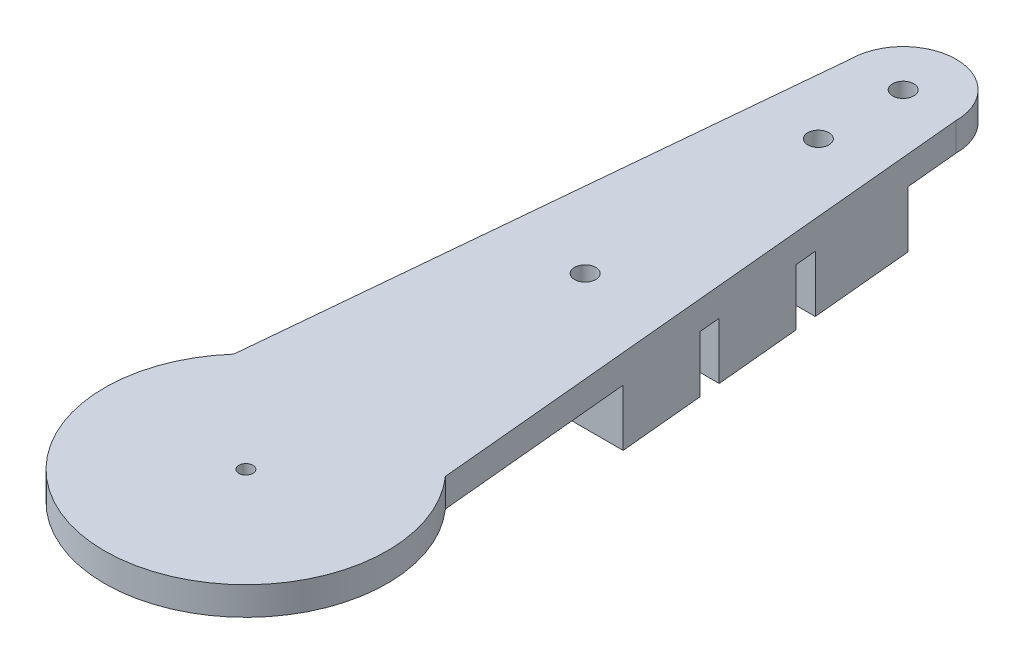
ISO-10303-21;
HEADER;
FILE_DESCRIPTION(('STEP AP214'),'2;1');
FILE_NAME('part.step','',(''),(''),'','','');
FILE_SCHEMA(('AUTOMOTIVE_DESIGN { 1 0 10303 214 1 1 1 1 }'));
ENDSEC;
DATA;
#1=APPLICATION_CONTEXT('core data for automotive mechanical design processes');
#2=APPLICATION_PROTOCOL_DEFINITION('international standard','automotive_design',2000,#1);
#3=PRODUCT_CONTEXT('',#1,'mechanical');
#4=PRODUCT('Part','Part','',(#3));
#5=PRODUCT_RELATED_PRODUCT_CATEGORY('part','',(#4));
#6=PRODUCT_DEFINITION_FORMATION('','',#4);
#7=PRODUCT_DEFINITION_CONTEXT('part definition',#1,'design');
#8=PRODUCT_DEFINITION('design','',#6,#7);
#9=PRODUCT_DEFINITION_SHAPE('','',#8);
#10=(LENGTH_UNIT() NAMED_UNIT(*) SI_UNIT(.MILLI.,.METRE.));
#11=(NAMED_UNIT(*) PLANE_ANGLE_UNIT() SI_UNIT($,.RADIAN.));
#12=(NAMED_UNIT(*) SI_UNIT($,.STERADIAN.) SOLID_ANGLE_UNIT());
#13=UNCERTAINTY_MEASURE_WITH_UNIT(LENGTH_MEASURE(1.E-05),#10,'distance_accuracy_value','');
#14=(GEOMETRIC_REPRESENTATION_CONTEXT(3) GLOBAL_UNCERTAINTY_ASSIGNED_CONTEXT((#13)) GLOBAL_UNIT_ASSIGNED_CONTEXT((#10,
#11,#12)) REPRESENTATION_CONTEXT('',''));
#15=CARTESIAN_POINT('',(0.,0.,0.));
#16=DIRECTION('',(0.,0.,1.));
#17=DIRECTION('',(1.,0.,0.));
#18=AXIS2_PLACEMENT_3D('',#15,#16,#17);
#19=CARTESIAN_POINT('',(0.,21.2132034355964,-93.));
#20=DIRECTION('',(0.,-1.,0.));
#21=DIRECTION('',(1.,0.,0.));
#22=AXIS2_PLACEMENT_3D('',#19,#20,#21);
#23=CYLINDRICAL_SURFACE('',#22,7.5);
#24=DIRECTION('',(0.,1.,0.));
#25=VECTOR('',#24,1.);
#26=CARTESIAN_POINT('',(7.5,-89.4400374531753,-93.));
#27=LINE('',#26,#25);
#28=CARTESIAN_POINT('',(7.50000000000001,-4.,-93.));
#29=VERTEX_POINT('',#28);
#30=CARTESIAN_POINT('',(7.49999999999999,0.,-93.));
#31=VERTEX_POINT('',#30);
#32=EDGE_CURVE('E169',#29,#31,#27,.T.);
#33=ORIENTED_EDGE('',*,*,#32,.F.);
#34=CARTESIAN_POINT('',(0.,-4.,-93.));
#35=DIRECTION('',(0.,-1.,0.));
#36=DIRECTION('',(1.,0.,0.));
#37=AXIS2_PLACEMENT_3D('',#34,#35,#36);
#38=CIRCLE('',#37,7.50000000000001);
#39=CARTESIAN_POINT('',(-7.50000000000001,-4.,-93.));
#40=VERTEX_POINT('',#39);
#41=EDGE_CURVE('E155',#40,#29,#38,.T.);
#42=ORIENTED_EDGE('',*,*,#41,.F.);
#43=DIRECTION('',(0.,1.,0.));
#44=VECTOR('',#43,1.);
#45=CARTESIAN_POINT('',(-7.5,-89.4400374531753,-93.));
#46=LINE('',#45,#44);
#47=CARTESIAN_POINT('',(-7.50000000000001,0.,-93.));
#48=VERTEX_POINT('',#47);
#49=EDGE_CURVE('E180',#40,#48,#46,.T.);
#50=ORIENTED_EDGE('',*,*,#49,.T.);
#51=CARTESIAN_POINT('',(0.,0.,-93.));
#52=DIRECTION('',(0.,-1.,0.));
#53=DIRECTION('',(1.,0.,0.));
#54=AXIS2_PLACEMENT_3D('',#51,#52,#53);
#55=CIRCLE('',#54,7.5);
#56=EDGE_CURVE('E177',#31,#48,#55,.F.);
#57=ORIENTED_EDGE('',*,*,#56,.F.);
#58=EDGE_LOOP('',(#33,#42,#50,#57));
#59=FACE_BOUND('',#58,.T.);
#60=ADVANCED_FACE('F43',(#59),#23,.T.);
#61=CARTESIAN_POINT('',(10.5,-4.,0.));
#62=DIRECTION('',(0.,1.,0.));
#63=DIRECTION('',(-1.,0.,0.));
#64=AXIS2_PLACEMENT_3D('',#61,#62,#63);
#65=PLANE('',#64);
#66=DIRECTION('',(-1.,0.,0.));
#67=VECTOR('',#66,1.);
#68=CARTESIAN_POINT('',(-9.56249999999999,-4.,-71.));
#69=LINE('',#68,#67);
#70=CARTESIAN_POINT('',(9.56249999999999,-4.,-71.));
#71=VERTEX_POINT('',#70);
#72=CARTESIAN_POINT('',(-9.56250000000001,-4.,-71.));
#73=VERTEX_POINT('',#72);
#74=EDGE_CURVE('E346',#71,#73,#69,.T.);
#75=ORIENTED_EDGE('',*,*,#74,.F.);
#76=DIRECTION('',(0.0933407086930584,0.,0.995634226059288));
#77=VECTOR('',#76,1.);
#78=CARTESIAN_POINT('',(7.49999999999999,-4.,-93.));
#79=LINE('',#78,#77);
#80=CARTESIAN_POINT('',(9.84374999999999,-4.,-68.));
#81=VERTEX_POINT('',#80);
#82=EDGE_CURVE('E190',#71,#81,#79,.T.);
#83=ORIENTED_EDGE('',*,*,#82,.T.);
#84=DIRECTION('',(1.,0.,0.));
#85=VECTOR('',#84,1.);
#86=CARTESIAN_POINT('',(9.84375,-4.,-68.));
#87=LINE('',#86,#85);
#88=CARTESIAN_POINT('',(-9.84375000000001,-4.,-68.));
#89=VERTEX_POINT('',#88);
#90=EDGE_CURVE('E379',#89,#81,#87,.T.);
#91=ORIENTED_EDGE('',*,*,#90,.F.);
#92=DIRECTION('',(0.0933407086930581,0.,-0.995634226059288));
#93=VECTOR('',#92,1.);
#94=CARTESIAN_POINT('',(-7.50000000000001,-4.,-93.));
#95=LINE('',#94,#93);
#96=EDGE_CURVE('E67',#89,#73,#95,.T.);
#97=ORIENTED_EDGE('',*,*,#96,.T.);
#98=EDGE_LOOP('',(#75,#83,#91,#97));
#99=FACE_BOUND('',#98,.T.);
#100=ADVANCED_FACE('F237',(#99),#65,.F.);
#101=DIRECTION('',(-1.,0.,0.));
#102=VECTOR('',#101,1.);
#103=CARTESIAN_POINT('',(-10.96875,-4.,-56.));
#104=LINE('',#103,#102);
#105=CARTESIAN_POINT('',(10.96875,-4.,-56.));
#106=VERTEX_POINT('',#105);
#107=CARTESIAN_POINT('',(-10.96875,-4.,-56.));
#108=VERTEX_POINT('',#107);
#109=EDGE_CURVE('E375',#106,#108,#104,.T.);
#110=ORIENTED_EDGE('',*,*,#109,.F.);
#111=CARTESIAN_POINT('',(11.25,-4.,-53.));
#112=VERTEX_POINT('',#111);
#113=EDGE_CURVE('E194',#106,#112,#79,.T.);
#114=ORIENTED_EDGE('',*,*,#113,.T.);
#115=DIRECTION('',(1.,0.,0.));
#116=VECTOR('',#115,1.);
#117=CARTESIAN_POINT('',(11.25,-4.,-53.));
#118=LINE('',#117,#116);
#119=CARTESIAN_POINT('',(-11.25,-4.,-53.));
#120=VERTEX_POINT('',#119);
#121=EDGE_CURVE('E384',#120,#112,#118,.T.);
#122=ORIENTED_EDGE('',*,*,#121,.F.);
#123=EDGE_CURVE('E433',#120,#108,#95,.T.);
#124=ORIENTED_EDGE('',*,*,#123,.T.);
#125=EDGE_LOOP('',(#110,#114,#122,#124));
#126=FACE_BOUND('',#125,.T.);
#127=ADVANCED_FACE('F235',(#126),#65,.F.);
#128=CARTESIAN_POINT('',(0.,-4.,0.));
#129=DIRECTION('',(0.,1.,0.));
#130=DIRECTION('',(-1.,0.,0.));
#131=AXIS2_PLACEMENT_3D('',#128,#129,#130);
#132=CIRCLE('',#131,10.5);
#133=CARTESIAN_POINT('',(-10.5,-4.,0.));
#134=VERTEX_POINT('',#133);
#135=EDGE_CURVE('E52',#134,#134,#132,.T.);
#136=ORIENTED_EDGE('',*,*,#135,.T.);
#137=EDGE_LOOP('',(#136));
#138=FACE_BOUND('',#137,.T.);
#139=DIRECTION('',(-1.,0.,0.));
#140=VECTOR('',#139,1.);
#141=CARTESIAN_POINT('',(-12.375,-4.,-41.));
#142=LINE('',#141,#140);
#143=CARTESIAN_POINT('',(12.375,-4.,-41.));
#144=VERTEX_POINT('',#143);
#145=CARTESIAN_POINT('',(-12.375,-4.,-41.));
#146=VERTEX_POINT('',#145);
#147=EDGE_CURVE('E401',#144,#146,#142,.T.);
#148=ORIENTED_EDGE('',*,*,#147,.F.);
#149=CARTESIAN_POINT('',(14.9760083530523,-4.,-13.2559109007759));
#150=VERTEX_POINT('',#149);
#151=EDGE_CURVE('E195',#144,#150,#79,.T.);
#152=ORIENTED_EDGE('',*,*,#151,.T.);
#153=CARTESIAN_POINT('',(0.,-4.,0.));
#154=DIRECTION('',(0.,1.,0.));
#155=DIRECTION('',(-1.,0.,0.));
#156=AXIS2_PLACEMENT_3D('',#153,#154,#155);
#157=CIRCLE('',#156,20.);
#158=CARTESIAN_POINT('',(-14.9760083530523,-4.,-13.2559109007759));
#159=VERTEX_POINT('',#158);
#160=EDGE_CURVE('E214',#159,#150,#157,.T.);
#161=ORIENTED_EDGE('',*,*,#160,.F.);
#162=EDGE_CURVE('E312',#159,#146,#95,.T.);
#163=ORIENTED_EDGE('',*,*,#162,.T.);
#164=EDGE_LOOP('',(#148,#152,#161,#163));
#165=FACE_BOUND('',#164,.T.);
#166=ADVANCED_FACE('F221',(#138,#165),#65,.F.);
#167=CARTESIAN_POINT('',(0.,-2.,0.));
#168=DIRECTION('',(0.,1.,0.));
#169=DIRECTION('',(-1.,0.,0.));
#170=AXIS2_PLACEMENT_3D('',#167,#168,#169);
#171=PLANE('',#170);
#172=CARTESIAN_POINT('',(0.,-2.,0.));
#173=DIRECTION('',(0.,1.,0.));
#174=DIRECTION('',(-1.,0.,0.));
#175=AXIS2_PLACEMENT_3D('',#172,#173,#174);
#176=CIRCLE('',#175,1.);
#177=CARTESIAN_POINT('',(-1.,-2.,0.));
#178=VERTEX_POINT('',#177);
#179=EDGE_CURVE('E206',#178,#178,#176,.T.);
#180=ORIENTED_EDGE('',*,*,#179,.T.);
#181=EDGE_LOOP('',(#180));
#182=FACE_BOUND('',#181,.T.);
#183=CARTESIAN_POINT('',(0.,-2.,0.));
#184=DIRECTION('',(0.,1.,0.));
#185=DIRECTION('',(-1.,0.,0.));
#186=AXIS2_PLACEMENT_3D('',#183,#184,#185);
#187=CIRCLE('',#186,10.5);
#188=CARTESIAN_POINT('',(-10.5,-2.,0.));
#189=VERTEX_POINT('',#188);
#190=EDGE_CURVE('E11',#189,#189,#187,.T.);
#191=ORIENTED_EDGE('',*,*,#190,.F.);
#192=EDGE_LOOP('',(#191));
#193=FACE_BOUND('',#192,.T.);
#194=ADVANCED_FACE('F45',(#182,#193),#171,.F.);
#195=CARTESIAN_POINT('',(0.,0.,0.));
#196=DIRECTION('',(0.,1.,0.));
#197=DIRECTION('',(-1.,0.,0.));
#198=AXIS2_PLACEMENT_3D('',#195,#196,#197);
#199=CYLINDRICAL_SURFACE('',#198,10.5);
#200=ORIENTED_EDGE('',*,*,#135,.F.);
#201=EDGE_LOOP('',(#200));
#202=FACE_BOUND('',#201,.T.);
#203=ORIENTED_EDGE('',*,*,#190,.T.);
#204=EDGE_LOOP('',(#203));
#205=FACE_BOUND('',#204,.T.);
#206=ADVANCED_FACE('F224',(#202,#205),#199,.F.);
#207=CARTESIAN_POINT('',(0.,0.,0.));
#208=DIRECTION('',(0.,1.,0.));
#209=DIRECTION('',(-1.,0.,0.));
#210=AXIS2_PLACEMENT_3D('',#207,#208,#209);
#211=CYLINDRICAL_SURFACE('',#210,20.);
#212=CARTESIAN_POINT('',(0.,0.,0.));
#213=DIRECTION('',(0.,1.,0.));
#214=DIRECTION('',(-1.,0.,0.));
#215=AXIS2_PLACEMENT_3D('',#212,#213,#214);
#216=CIRCLE('',#215,20.);
#217=CARTESIAN_POINT('',(-14.9760083530523,0.,-13.2559109007759));
#218=VERTEX_POINT('',#217);
#219=CARTESIAN_POINT('',(14.9760083530523,0.,-13.2559109007759));
#220=VERTEX_POINT('',#219);
#221=EDGE_CURVE('E210',#218,#220,#216,.T.);
#222=ORIENTED_EDGE('',*,*,#221,.F.);
#223=DIRECTION('',(0.,1.,0.));
#224=VECTOR('',#223,1.);
#225=CARTESIAN_POINT('',(-14.9760083530523,0.,-13.2559109007759));
#226=LINE('',#225,#224);
#227=EDGE_CURVE('E198',#218,#159,#226,.F.);
#228=ORIENTED_EDGE('',*,*,#227,.T.);
#229=ORIENTED_EDGE('',*,*,#160,.T.);
#230=DIRECTION('',(0.,1.,0.));
#231=VECTOR('',#230,1.);
#232=CARTESIAN_POINT('',(14.9760083530523,0.,-13.2559109007759));
#233=LINE('',#232,#231);
#234=EDGE_CURVE('E193',#150,#220,#233,.T.);
#235=ORIENTED_EDGE('',*,*,#234,.T.);
#236=EDGE_LOOP('',(#222,#228,#229,#235));
#237=FACE_BOUND('',#236,.T.);
#238=ADVANCED_FACE('F227',(#237),#211,.T.);
#239=CARTESIAN_POINT('',(0.,0.,0.));
#240=DIRECTION('',(0.,-1.,0.));
#241=DIRECTION('',(1.,0.,0.));
#242=AXIS2_PLACEMENT_3D('',#239,#240,#241);
#243=PLANE('',#242);
#244=CARTESIAN_POINT('',(0.,0.,-93.));
#245=DIRECTION('',(0.,1.,0.));
#246=DIRECTION('',(-1.,0.,0.));
#247=AXIS2_PLACEMENT_3D('',#244,#245,#246);
#248=CIRCLE('',#247,1.5);
#249=CARTESIAN_POINT('',(-1.50000000000001,0.,-93.));
#250=VERTEX_POINT('',#249);
#251=EDGE_CURVE('E474',#250,#250,#248,.T.);
#252=ORIENTED_EDGE('',*,*,#251,.F.);
#253=EDGE_LOOP('',(#252));
#254=FACE_BOUND('',#253,.T.);
#255=CARTESIAN_POINT('',(0.,0.,-48.));
#256=DIRECTION('',(0.,1.,0.));
#257=DIRECTION('',(-1.,0.,0.));
#258=AXIS2_PLACEMENT_3D('',#255,#256,#257);
#259=CIRCLE('',#258,1.5);
#260=CARTESIAN_POINT('',(-1.5,0.,-48.));
#261=VERTEX_POINT('',#260);
#262=EDGE_CURVE('E326',#261,#261,#259,.T.);
#263=ORIENTED_EDGE('',*,*,#262,.F.);
#264=EDGE_LOOP('',(#263));
#265=FACE_BOUND('',#264,.T.);
#266=CARTESIAN_POINT('',(0.,0.,-81.));
#267=DIRECTION('',(0.,1.,0.));
#268=DIRECTION('',(-1.,0.,0.));
#269=AXIS2_PLACEMENT_3D('',#266,#267,#268);
#270=CIRCLE('',#269,1.5);
#271=CARTESIAN_POINT('',(-1.5,0.,-81.));
#272=VERTEX_POINT('',#271);
#273=EDGE_CURVE('E321',#272,#272,#270,.T.);
#274=ORIENTED_EDGE('',*,*,#273,.F.);
#275=EDGE_LOOP('',(#274));
#276=FACE_BOUND('',#275,.T.);
#277=DIRECTION('',(-0.0933407086930584,0.,-0.995634226059288));
#278=VECTOR('',#277,1.);
#279=CARTESIAN_POINT('',(7.49999999999999,0.,-93.));
#280=LINE('',#279,#278);
#281=EDGE_CURVE('E187',#220,#31,#280,.T.);
#282=ORIENTED_EDGE('',*,*,#281,.T.);
#283=ORIENTED_EDGE('',*,*,#56,.T.);
#284=DIRECTION('',(-0.0933407086930581,0.,0.995634226059288));
#285=VECTOR('',#284,1.);
#286=CARTESIAN_POINT('',(-7.50000000000001,0.,-93.));
#287=LINE('',#286,#285);
#288=EDGE_CURVE('E181',#48,#218,#287,.T.);
#289=ORIENTED_EDGE('',*,*,#288,.T.);
#290=ORIENTED_EDGE('',*,*,#221,.T.);
#291=EDGE_LOOP('',(#282,#283,#289,#290));
#292=FACE_BOUND('',#291,.T.);
#293=CARTESIAN_POINT('',(0.,0.,0.));
#294=DIRECTION('',(0.,1.,0.));
#295=DIRECTION('',(-1.,0.,0.));
#296=AXIS2_PLACEMENT_3D('',#293,#294,#295);
#297=CIRCLE('',#296,1.);
#298=CARTESIAN_POINT('',(-1.,0.,0.));
#299=VERTEX_POINT('',#298);
#300=EDGE_CURVE('E202',#299,#299,#297,.T.);
#301=ORIENTED_EDGE('',*,*,#300,.F.);
#302=EDGE_LOOP('',(#301));
#303=FACE_BOUND('',#302,.T.);
#304=ADVANCED_FACE('F296',(#254,#265,#276,#292,#303),#243,.F.);
#305=CARTESIAN_POINT('',(0.,-10.,0.));
#306=DIRECTION('',(0.,1.,0.));
#307=DIRECTION('',(-1.,0.,0.));
#308=AXIS2_PLACEMENT_3D('',#305,#306,#307);
#309=CYLINDRICAL_SURFACE('',#308,1.);
#310=ORIENTED_EDGE('',*,*,#300,.T.);
#311=EDGE_LOOP('',(#310));
#312=FACE_BOUND('',#311,.T.);
#313=ORIENTED_EDGE('',*,*,#179,.F.);
#314=EDGE_LOOP('',(#313));
#315=FACE_BOUND('',#314,.T.);
#316=ADVANCED_FACE('F290',(#312,#315),#309,.F.);
#317=CARTESIAN_POINT('',(-7.5,-89.4400374531753,-93.));
#318=DIRECTION('',(-0.995634226059288,0.,-0.0933407086930581));
#319=DIRECTION('',(-0.0933407086930581,0.,0.995634226059288));
#320=AXIS2_PLACEMENT_3D('',#317,#318,#319);
#321=PLANE('',#320);
#322=DIRECTION('',(0.,-1.,0.));
#323=VECTOR('',#322,1.);
#324=CARTESIAN_POINT('',(-8.20312500000001,-4.,-85.5));
#325=LINE('',#324,#323);
#326=CARTESIAN_POINT('',(-8.20312500000001,-4.,-85.5));
#327=VERTEX_POINT('',#326);
#328=CARTESIAN_POINT('',(-8.20312500000001,-12.,-85.5));
#329=VERTEX_POINT('',#328);
#330=EDGE_CURVE('E316',#327,#329,#325,.T.);
#331=ORIENTED_EDGE('',*,*,#330,.T.);
#332=DIRECTION('',(0.0933407086930576,0.,-0.995634226059288));
#333=VECTOR('',#332,1.);
#334=CARTESIAN_POINT('',(-7.50000000000001,-12.,-93.));
#335=LINE('',#334,#333);
#336=CARTESIAN_POINT('',(-9.56249999999999,-12.,-71.));
#337=VERTEX_POINT('',#336);
#338=EDGE_CURVE('E350',#337,#329,#335,.T.);
#339=ORIENTED_EDGE('',*,*,#338,.F.);
#340=DIRECTION('',(0.,1.,0.));
#341=VECTOR('',#340,1.);
#342=CARTESIAN_POINT('',(-9.56249999999999,-12.,-71.));
#343=LINE('',#342,#341);
#344=EDGE_CURVE('E341',#337,#73,#343,.T.);
#345=ORIENTED_EDGE('',*,*,#344,.T.);
#346=ORIENTED_EDGE('',*,*,#96,.F.);
#347=DIRECTION('',(0.,1.,0.));
#348=VECTOR('',#347,1.);
#349=CARTESIAN_POINT('',(-9.84374999999999,-12.,-68.));
#350=LINE('',#349,#348);
#351=CARTESIAN_POINT('',(-9.84374999999999,-12.,-68.));
#352=VERTEX_POINT('',#351);
#353=EDGE_CURVE('E349',#352,#89,#350,.T.);
#354=ORIENTED_EDGE('',*,*,#353,.F.);
#355=DIRECTION('',(0.0933407086930584,0.,-0.995634226059288));
#356=VECTOR('',#355,1.);
#357=CARTESIAN_POINT('',(-9.84374999999999,-12.,-68.));
#358=LINE('',#357,#356);
#359=CARTESIAN_POINT('',(-10.96875,-12.,-56.));
#360=VERTEX_POINT('',#359);
#361=EDGE_CURVE('E380',#360,#352,#358,.T.);
#362=ORIENTED_EDGE('',*,*,#361,.F.);
#363=DIRECTION('',(0.,1.,0.));
#364=VECTOR('',#363,1.);
#365=CARTESIAN_POINT('',(-10.96875,-12.,-56.));
#366=LINE('',#365,#364);
#367=EDGE_CURVE('E370',#360,#108,#366,.T.);
#368=ORIENTED_EDGE('',*,*,#367,.T.);
#369=ORIENTED_EDGE('',*,*,#123,.F.);
#370=DIRECTION('',(0.,1.,0.));
#371=VECTOR('',#370,1.);
#372=CARTESIAN_POINT('',(-11.25,-12.,-53.));
#373=LINE('',#372,#371);
#374=CARTESIAN_POINT('',(-11.25,-12.,-53.));
#375=VERTEX_POINT('',#374);
#376=EDGE_CURVE('E427',#375,#120,#373,.T.);
#377=ORIENTED_EDGE('',*,*,#376,.F.);
#378=DIRECTION('',(0.093340708693058,0.,-0.995634226059288));
#379=VECTOR('',#378,1.);
#380=CARTESIAN_POINT('',(-11.25,-12.,-53.));
#381=LINE('',#380,#379);
#382=CARTESIAN_POINT('',(-12.375,-12.,-41.));
#383=VERTEX_POINT('',#382);
#384=EDGE_CURVE('E396',#383,#375,#381,.T.);
#385=ORIENTED_EDGE('',*,*,#384,.F.);
#386=DIRECTION('',(0.,1.,0.));
#387=VECTOR('',#386,1.);
#388=CARTESIAN_POINT('',(-12.375,-12.,-41.));
#389=LINE('',#388,#387);
#390=EDGE_CURVE('E410',#383,#146,#389,.T.);
#391=ORIENTED_EDGE('',*,*,#390,.T.);
#392=ORIENTED_EDGE('',*,*,#162,.F.);
#393=ORIENTED_EDGE('',*,*,#227,.F.);
#394=ORIENTED_EDGE('',*,*,#288,.F.);
#395=ORIENTED_EDGE('',*,*,#49,.F.);
#396=DIRECTION('',(0.0933407086930584,0.,-0.995634226059288));
#397=VECTOR('',#396,1.);
#398=CARTESIAN_POINT('',(-8.20312500000001,-4.,-85.5));
#399=LINE('',#398,#397);
#400=EDGE_CURVE('E59',#327,#40,#399,.T.);
#401=ORIENTED_EDGE('',*,*,#400,.F.);
#402=EDGE_LOOP('',(#331,#339,#345,#346,#354,#362,#368,#369,#377,#385,#391,#392,#393,#394,#395,#401));
#403=FACE_BOUND('',#402,.T.);
#404=ADVANCED_FACE('F287',(#403),#321,.T.);
#405=CARTESIAN_POINT('',(7.5,-89.4400374531753,-93.));
#406=DIRECTION('',(0.995634226059288,0.,-0.0933407086930584));
#407=DIRECTION('',(-0.0933407086930584,0.,-0.995634226059288));
#408=AXIS2_PLACEMENT_3D('',#405,#406,#407);
#409=PLANE('',#408);
#410=DIRECTION('',(0.,-1.,0.));
#411=VECTOR('',#410,1.);
#412=CARTESIAN_POINT('',(8.203125,-4.,-85.5));
#413=LINE('',#412,#411);
#414=CARTESIAN_POINT('',(8.203125,-4.,-85.5));
#415=VERTEX_POINT('',#414);
#416=CARTESIAN_POINT('',(8.203125,-12.,-85.5));
#417=VERTEX_POINT('',#416);
#418=EDGE_CURVE('E172',#415,#417,#413,.T.);
#419=ORIENTED_EDGE('',*,*,#418,.F.);
#420=DIRECTION('',(0.0933407086930561,0.,0.995634226059288));
#421=VECTOR('',#420,1.);
#422=CARTESIAN_POINT('',(8.203125,-4.,-85.5));
#423=LINE('',#422,#421);
#424=EDGE_CURVE('E158',#29,#415,#423,.T.);
#425=ORIENTED_EDGE('',*,*,#424,.F.);
#426=ORIENTED_EDGE('',*,*,#32,.T.);
#427=ORIENTED_EDGE('',*,*,#281,.F.);
#428=ORIENTED_EDGE('',*,*,#234,.F.);
#429=ORIENTED_EDGE('',*,*,#151,.F.);
#430=DIRECTION('',(0.,1.,0.));
#431=VECTOR('',#430,1.);
#432=CARTESIAN_POINT('',(12.375,-12.,-41.));
#433=LINE('',#432,#431);
#434=CARTESIAN_POINT('',(12.375,-12.,-41.));
#435=VERTEX_POINT('',#434);
#436=EDGE_CURVE('E419',#435,#144,#433,.T.);
#437=ORIENTED_EDGE('',*,*,#436,.F.);
#438=DIRECTION('',(0.093340708693058,0.,0.995634226059288));
#439=VECTOR('',#438,1.);
#440=CARTESIAN_POINT('',(12.375,-12.,-41.));
#441=LINE('',#440,#439);
#442=CARTESIAN_POINT('',(11.25,-12.,-53.));
#443=VERTEX_POINT('',#442);
#444=EDGE_CURVE('E404',#443,#435,#441,.T.);
#445=ORIENTED_EDGE('',*,*,#444,.F.);
#446=DIRECTION('',(0.,1.,0.));
#447=VECTOR('',#446,1.);
#448=CARTESIAN_POINT('',(11.25,-12.,-53.));
#449=LINE('',#448,#447);
#450=EDGE_CURVE('E423',#443,#112,#449,.T.);
#451=ORIENTED_EDGE('',*,*,#450,.T.);
#452=ORIENTED_EDGE('',*,*,#113,.F.);
#453=DIRECTION('',(0.,1.,0.));
#454=VECTOR('',#453,1.);
#455=CARTESIAN_POINT('',(10.96875,-12.,-56.));
#456=LINE('',#455,#454);
#457=CARTESIAN_POINT('',(10.96875,-12.,-56.));
#458=VERTEX_POINT('',#457);
#459=EDGE_CURVE('E366',#458,#106,#456,.T.);
#460=ORIENTED_EDGE('',*,*,#459,.F.);
#461=DIRECTION('',(0.0933407086930584,0.,0.995634226059288));
#462=VECTOR('',#461,1.);
#463=CARTESIAN_POINT('',(10.96875,-12.,-56.));
#464=LINE('',#463,#462);
#465=CARTESIAN_POINT('',(9.84375,-12.,-68.));
#466=VERTEX_POINT('',#465);
#467=EDGE_CURVE('E387',#466,#458,#464,.T.);
#468=ORIENTED_EDGE('',*,*,#467,.F.);
#469=DIRECTION('',(0.,1.,0.));
#470=VECTOR('',#469,1.);
#471=CARTESIAN_POINT('',(9.84375,-12.,-68.));
#472=LINE('',#471,#470);
#473=EDGE_CURVE('E362',#466,#81,#472,.T.);
#474=ORIENTED_EDGE('',*,*,#473,.T.);
#475=ORIENTED_EDGE('',*,*,#82,.F.);
#476=DIRECTION('',(0.,1.,0.));
#477=VECTOR('',#476,1.);
#478=CARTESIAN_POINT('',(9.5625,-12.,-71.));
#479=LINE('',#478,#477);
#480=CARTESIAN_POINT('',(9.5625,-12.,-71.));
#481=VERTEX_POINT('',#480);
#482=EDGE_CURVE('E333',#481,#71,#479,.T.);
#483=ORIENTED_EDGE('',*,*,#482,.F.);
#484=DIRECTION('',(0.0933407086930589,0.,0.995634226059288));
#485=VECTOR('',#484,1.);
#486=CARTESIAN_POINT('',(9.5625,-12.,-71.));
#487=LINE('',#486,#485);
#488=EDGE_CURVE('E353',#417,#481,#487,.T.);
#489=ORIENTED_EDGE('',*,*,#488,.F.);
#490=EDGE_LOOP('',(#419,#425,#426,#427,#428,#429,#437,#445,#451,#452,#460,#468,#474,#475,#483,#489));
#491=FACE_BOUND('',#490,.T.);
#492=ADVANCED_FACE('F167',(#491),#409,.T.);
#493=CARTESIAN_POINT('',(11.25,-12.,-53.));
#494=DIRECTION('',(0.,0.,1.));
#495=DIRECTION('',(1.,0.,0.));
#496=AXIS2_PLACEMENT_3D('',#493,#494,#495);
#497=PLANE('',#496);
#498=ORIENTED_EDGE('',*,*,#121,.T.);
#499=ORIENTED_EDGE('',*,*,#450,.F.);
#500=DIRECTION('',(1.,0.,0.));
#501=VECTOR('',#500,1.);
#502=CARTESIAN_POINT('',(11.25,-12.,-53.));
#503=LINE('',#502,#501);
#504=EDGE_CURVE('E400',#375,#443,#503,.T.);
#505=ORIENTED_EDGE('',*,*,#504,.F.);
#506=ORIENTED_EDGE('',*,*,#376,.T.);
#507=EDGE_LOOP('',(#498,#499,#505,#506));
#508=FACE_BOUND('',#507,.T.);
#509=ADVANCED_FACE('F282',(#508),#497,.F.);
#510=CARTESIAN_POINT('',(-12.375,-12.,-41.));
#511=DIRECTION('',(0.,0.,-1.));
#512=DIRECTION('',(-1.,0.,0.));
#513=AXIS2_PLACEMENT_3D('',#510,#511,#512);
#514=PLANE('',#513);
#515=ORIENTED_EDGE('',*,*,#147,.T.);
#516=ORIENTED_EDGE('',*,*,#390,.F.);
#517=DIRECTION('',(-1.,0.,0.));
#518=VECTOR('',#517,1.);
#519=CARTESIAN_POINT('',(-12.375,-12.,-41.));
#520=LINE('',#519,#518);
#521=EDGE_CURVE('E407',#435,#383,#520,.T.);
#522=ORIENTED_EDGE('',*,*,#521,.F.);
#523=ORIENTED_EDGE('',*,*,#436,.T.);
#524=EDGE_LOOP('',(#515,#516,#522,#523));
#525=FACE_BOUND('',#524,.T.);
#526=ADVANCED_FACE('F278',(#525),#514,.F.);
#527=CARTESIAN_POINT('',(0.,-12.,0.));
#528=DIRECTION('',(0.,1.,0.));
#529=DIRECTION('',(-1.,0.,0.));
#530=AXIS2_PLACEMENT_3D('',#527,#528,#529);
#531=PLANE('',#530);
#532=CARTESIAN_POINT('',(0.,-12.,-48.));
#533=DIRECTION('',(0.,1.,0.));
#534=DIRECTION('',(-1.,0.,0.));
#535=AXIS2_PLACEMENT_3D('',#532,#533,#534);
#536=CIRCLE('',#535,1.5);
#537=CARTESIAN_POINT('',(-1.5,-12.,-48.));
#538=VERTEX_POINT('',#537);
#539=EDGE_CURVE('E330',#538,#538,#536,.F.);
#540=ORIENTED_EDGE('',*,*,#539,.F.);
#541=EDGE_LOOP('',(#540));
#542=FACE_BOUND('',#541,.T.);
#543=ORIENTED_EDGE('',*,*,#384,.T.);
#544=ORIENTED_EDGE('',*,*,#504,.T.);
#545=ORIENTED_EDGE('',*,*,#444,.T.);
#546=ORIENTED_EDGE('',*,*,#521,.T.);
#547=EDGE_LOOP('',(#543,#544,#545,#546));
#548=FACE_BOUND('',#547,.T.);
#549=ADVANCED_FACE('F268',(#542,#548),#531,.F.);
#550=CARTESIAN_POINT('',(9.84375,-12.,-68.));
#551=DIRECTION('',(0.,0.,1.));
#552=DIRECTION('',(1.,0.,0.));
#553=AXIS2_PLACEMENT_3D('',#550,#551,#552);
#554=PLANE('',#553);
#555=ORIENTED_EDGE('',*,*,#90,.T.);
#556=ORIENTED_EDGE('',*,*,#473,.F.);
#557=DIRECTION('',(1.,0.,0.));
#558=VECTOR('',#557,1.);
#559=CARTESIAN_POINT('',(9.84375,-12.,-68.));
#560=LINE('',#559,#558);
#561=EDGE_CURVE('E390',#352,#466,#560,.T.);
#562=ORIENTED_EDGE('',*,*,#561,.F.);
#563=ORIENTED_EDGE('',*,*,#353,.T.);
#564=EDGE_LOOP('',(#555,#556,#562,#563));
#565=FACE_BOUND('',#564,.T.);
#566=ADVANCED_FACE('F264',(#565),#554,.F.);
#567=CARTESIAN_POINT('',(-10.96875,-12.,-56.));
#568=DIRECTION('',(0.,0.,-1.));
#569=DIRECTION('',(-1.,0.,0.));
#570=AXIS2_PLACEMENT_3D('',#567,#568,#569);
#571=PLANE('',#570);
#572=ORIENTED_EDGE('',*,*,#109,.T.);
#573=ORIENTED_EDGE('',*,*,#367,.F.);
#574=DIRECTION('',(-1.,0.,0.));
#575=VECTOR('',#574,1.);
#576=CARTESIAN_POINT('',(-10.96875,-12.,-56.));
#577=LINE('',#576,#575);
#578=EDGE_CURVE('E374',#458,#360,#577,.T.);
#579=ORIENTED_EDGE('',*,*,#578,.F.);
#580=ORIENTED_EDGE('',*,*,#459,.T.);
#581=EDGE_LOOP('',(#572,#573,#579,#580));
#582=FACE_BOUND('',#581,.T.);
#583=ADVANCED_FACE('F267',(#582),#571,.F.);
#584=CARTESIAN_POINT('',(0.,-12.,0.));
#585=DIRECTION('',(0.,1.,0.));
#586=DIRECTION('',(-1.,0.,0.));
#587=AXIS2_PLACEMENT_3D('',#584,#585,#586);
#588=PLANE('',#587);
#589=ORIENTED_EDGE('',*,*,#361,.T.);
#590=ORIENTED_EDGE('',*,*,#561,.T.);
#591=ORIENTED_EDGE('',*,*,#467,.T.);
#592=ORIENTED_EDGE('',*,*,#578,.T.);
#593=EDGE_LOOP('',(#589,#590,#591,#592));
#594=FACE_BOUND('',#593,.T.);
#595=ADVANCED_FACE('F259',(#594),#588,.F.);
#596=CARTESIAN_POINT('',(-9.56249999999999,-12.,-71.));
#597=DIRECTION('',(0.,0.,-1.));
#598=DIRECTION('',(-1.,0.,0.));
#599=AXIS2_PLACEMENT_3D('',#596,#597,#598);
#600=PLANE('',#599);
#601=ORIENTED_EDGE('',*,*,#74,.T.);
#602=ORIENTED_EDGE('',*,*,#344,.F.);
#603=DIRECTION('',(-1.,0.,0.));
#604=VECTOR('',#603,1.);
#605=CARTESIAN_POINT('',(-9.56249999999999,-12.,-71.));
#606=LINE('',#605,#604);
#607=EDGE_CURVE('E345',#481,#337,#606,.T.);
#608=ORIENTED_EDGE('',*,*,#607,.F.);
#609=ORIENTED_EDGE('',*,*,#482,.T.);
#610=EDGE_LOOP('',(#601,#602,#608,#609));
#611=FACE_BOUND('',#610,.T.);
#612=ADVANCED_FACE('F256',(#611),#600,.F.);
#613=CARTESIAN_POINT('',(0.,-12.,0.));
#614=DIRECTION('',(0.,1.,0.));
#615=DIRECTION('',(-1.,0.,0.));
#616=AXIS2_PLACEMENT_3D('',#613,#614,#615);
#617=PLANE('',#616);
#618=CARTESIAN_POINT('',(0.,-12.,-81.));
#619=DIRECTION('',(0.,1.,0.));
#620=DIRECTION('',(-1.,0.,0.));
#621=AXIS2_PLACEMENT_3D('',#618,#619,#620);
#622=CIRCLE('',#621,1.5);
#623=CARTESIAN_POINT('',(-1.5,-12.,-81.));
#624=VERTEX_POINT('',#623);
#625=EDGE_CURVE('E315',#624,#624,#622,.F.);
#626=ORIENTED_EDGE('',*,*,#625,.F.);
#627=EDGE_LOOP('',(#626));
#628=FACE_BOUND('',#627,.T.);
#629=ORIENTED_EDGE('',*,*,#338,.T.);
#630=DIRECTION('',(-1.,0.,0.));
#631=VECTOR('',#630,1.);
#632=CARTESIAN_POINT('',(-8.20312500000001,-12.,-85.5));
#633=LINE('',#632,#631);
#634=EDGE_CURVE('E465',#417,#329,#633,.T.);
#635=ORIENTED_EDGE('',*,*,#634,.F.);
#636=ORIENTED_EDGE('',*,*,#488,.T.);
#637=ORIENTED_EDGE('',*,*,#607,.T.);
#638=EDGE_LOOP('',(#629,#635,#636,#637));
#639=FACE_BOUND('',#638,.T.);
#640=ADVANCED_FACE('F254',(#628,#639),#617,.F.);
#641=CARTESIAN_POINT('',(0.,-16.2426406871193,-81.));
#642=DIRECTION('',(0.,1.,0.));
#643=DIRECTION('',(-1.,0.,0.));
#644=AXIS2_PLACEMENT_3D('',#641,#642,#643);
#645=CYLINDRICAL_SURFACE('',#644,1.5);
#646=ORIENTED_EDGE('',*,*,#625,.T.);
#647=EDGE_LOOP('',(#646));
#648=FACE_BOUND('',#647,.T.);
#649=ORIENTED_EDGE('',*,*,#273,.T.);
#650=EDGE_LOOP('',(#649));
#651=FACE_BOUND('',#650,.T.);
#652=ADVANCED_FACE('F250',(#648,#651),#645,.F.);
#653=CARTESIAN_POINT('',(0.,-16.2426406871193,-48.));
#654=DIRECTION('',(0.,1.,0.));
#655=DIRECTION('',(-1.,0.,0.));
#656=AXIS2_PLACEMENT_3D('',#653,#654,#655);
#657=CYLINDRICAL_SURFACE('',#656,1.5);
#658=ORIENTED_EDGE('',*,*,#539,.T.);
#659=EDGE_LOOP('',(#658));
#660=FACE_BOUND('',#659,.T.);
#661=ORIENTED_EDGE('',*,*,#262,.T.);
#662=EDGE_LOOP('',(#661));
#663=FACE_BOUND('',#662,.T.);
#664=ADVANCED_FACE('F247',(#660,#663),#657,.F.);
#665=CARTESIAN_POINT('',(-8.20312500000001,-4.,-85.5));
#666=DIRECTION('',(0.,0.,1.));
#667=DIRECTION('',(0.,-1.,0.));
#668=AXIS2_PLACEMENT_3D('',#665,#666,#667);
#669=PLANE('',#668);
#670=ORIENTED_EDGE('',*,*,#634,.T.);
#671=ORIENTED_EDGE('',*,*,#330,.F.);
#672=DIRECTION('',(-1.,0.,0.));
#673=VECTOR('',#672,1.);
#674=CARTESIAN_POINT('',(-8.20312500000001,-4.,-85.5));
#675=LINE('',#674,#673);
#676=EDGE_CURVE('E174',#415,#327,#675,.T.);
#677=ORIENTED_EDGE('',*,*,#676,.F.);
#678=ORIENTED_EDGE('',*,*,#418,.T.);
#679=EDGE_LOOP('',(#670,#671,#677,#678));
#680=FACE_BOUND('',#679,.T.);
#681=ADVANCED_FACE('F245',(#680),#669,.F.);
#682=CARTESIAN_POINT('',(0.,-4.,-93.));
#683=DIRECTION('',(0.,-1.,0.));
#684=DIRECTION('',(1.,0.,0.));
#685=AXIS2_PLACEMENT_3D('',#682,#683,#684);
#686=PLANE('',#685);
#687=CARTESIAN_POINT('',(0.,-4.,-93.));
#688=DIRECTION('',(0.,-1.,0.));
#689=DIRECTION('',(1.,0.,0.));
#690=AXIS2_PLACEMENT_3D('',#687,#688,#689);
#691=CIRCLE('',#690,1.5);
#692=CARTESIAN_POINT('',(1.49999999999999,-4.,-93.));
#693=VERTEX_POINT('',#692);
#694=EDGE_CURVE('E468',#693,#693,#691,.F.);
#695=ORIENTED_EDGE('',*,*,#694,.T.);
#696=EDGE_LOOP('',(#695));
#697=FACE_BOUND('',#696,.T.);
#698=ORIENTED_EDGE('',*,*,#400,.T.);
#699=ORIENTED_EDGE('',*,*,#41,.T.);
#700=ORIENTED_EDGE('',*,*,#424,.T.);
#701=ORIENTED_EDGE('',*,*,#676,.T.);
#702=EDGE_LOOP('',(#698,#699,#700,#701));
#703=FACE_BOUND('',#702,.T.);
#704=ADVANCED_FACE('F157',(#697,#703),#686,.T.);
#705=CARTESIAN_POINT('',(0.,-8.24264068711929,-93.));
#706=DIRECTION('',(0.,1.,0.));
#707=DIRECTION('',(-1.,0.,0.));
#708=AXIS2_PLACEMENT_3D('',#705,#706,#707);
#709=CYLINDRICAL_SURFACE('',#708,1.5);
#710=ORIENTED_EDGE('',*,*,#251,.T.);
#711=EDGE_LOOP('',(#710));
#712=FACE_BOUND('',#711,.T.);
#713=ORIENTED_EDGE('',*,*,#694,.F.);
#714=EDGE_LOOP('',(#713));
#715=FACE_BOUND('',#714,.T.);
#716=ADVANCED_FACE('F483',(#712,#715),#709,.F.);
#717=CLOSED_SHELL('',(#60,#100,#127,#166,#194,#206,#238,#304,#316,#404,#492,#509,#526,#549,#566,
#583,#595,#612,#640,#652,#664,#681,#704,#716));
#718=MANIFOLD_SOLID_BREP('B2',#717);
#719=ADVANCED_BREP_SHAPE_REPRESENTATION('',(#18,#718),#14);
#720=SHAPE_DEFINITION_REPRESENTATION(#9,#719);
ENDSEC;
END-ISO-10303-21;
